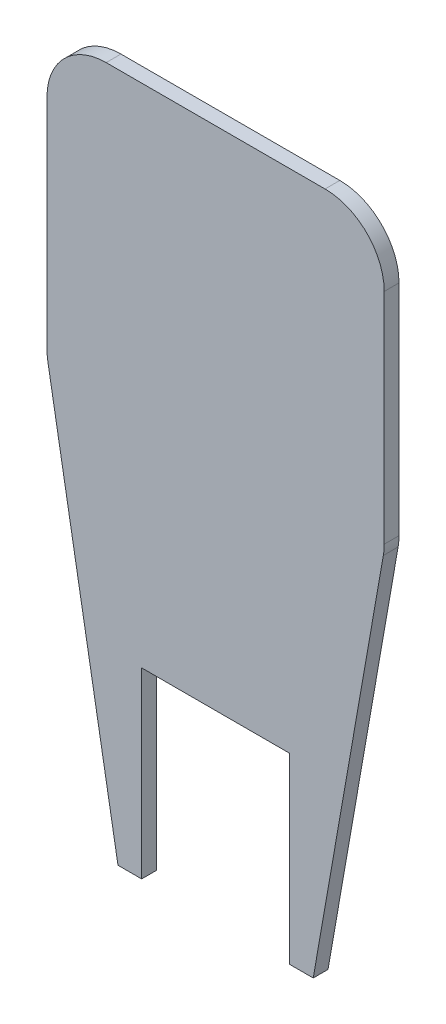
ISO-10303-21;
HEADER;
FILE_DESCRIPTION(('STEP AP214'),'2;1');
FILE_NAME('part.step','',(''),(''),'','','');
FILE_SCHEMA(('AUTOMOTIVE_DESIGN { 1 0 10303 214 1 1 1 1 }'));
ENDSEC;
DATA;
#1=APPLICATION_CONTEXT('core data for automotive mechanical design processes');
#2=APPLICATION_PROTOCOL_DEFINITION('international standard','automotive_design',2000,#1);
#3=PRODUCT_CONTEXT('',#1,'mechanical');
#4=PRODUCT('Part','Part','',(#3));
#5=PRODUCT_RELATED_PRODUCT_CATEGORY('part','',(#4));
#6=PRODUCT_DEFINITION_FORMATION('','',#4);
#7=PRODUCT_DEFINITION_CONTEXT('part definition',#1,'design');
#8=PRODUCT_DEFINITION('design','',#6,#7);
#9=PRODUCT_DEFINITION_SHAPE('','',#8);
#10=(LENGTH_UNIT() NAMED_UNIT(*) SI_UNIT(.MILLI.,.METRE.));
#11=(NAMED_UNIT(*) PLANE_ANGLE_UNIT() SI_UNIT($,.RADIAN.));
#12=(NAMED_UNIT(*) SI_UNIT($,.STERADIAN.) SOLID_ANGLE_UNIT());
#13=UNCERTAINTY_MEASURE_WITH_UNIT(LENGTH_MEASURE(1.E-05),#10,'distance_accuracy_value','');
#14=(GEOMETRIC_REPRESENTATION_CONTEXT(3) GLOBAL_UNCERTAINTY_ASSIGNED_CONTEXT((#13)) GLOBAL_UNIT_ASSIGNED_CONTEXT((#10,
#11,#12)) REPRESENTATION_CONTEXT('',''));
#15=CARTESIAN_POINT('',(0.,0.,0.));
#16=DIRECTION('',(0.,0.,1.));
#17=DIRECTION('',(1.,0.,0.));
#18=AXIS2_PLACEMENT_3D('',#15,#16,#17);
#19=CARTESIAN_POINT('',(18.5,18.5,2.5));
#20=DIRECTION('',(0.,0.,-1.));
#21=DIRECTION('',(-1.,0.,0.));
#22=AXIS2_PLACEMENT_3D('',#19,#20,#21);
#23=CYLINDRICAL_SURFACE('',#22,10.);
#24=CARTESIAN_POINT('',(18.5,18.5,0.));
#25=DIRECTION('',(0.,0.,1.));
#26=DIRECTION('',(-1.,0.,0.));
#27=AXIS2_PLACEMENT_3D('',#24,#25,#26);
#28=CIRCLE('',#27,10.);
#29=CARTESIAN_POINT('',(28.5,18.4999999999999,0.));
#30=VERTEX_POINT('',#29);
#31=CARTESIAN_POINT('',(18.4999999999999,28.5,0.));
#32=VERTEX_POINT('',#31);
#33=EDGE_CURVE('E165',#30,#32,#28,.T.);
#34=ORIENTED_EDGE('',*,*,#33,.T.);
#35=DIRECTION('',(0.,0.,-1.));
#36=VECTOR('',#35,1.);
#37=CARTESIAN_POINT('',(18.4999999999999,28.5,2.5));
#38=LINE('',#37,#36);
#39=CARTESIAN_POINT('',(18.4999999999999,28.5,2.5));
#40=VERTEX_POINT('',#39);
#41=EDGE_CURVE('E11',#40,#32,#38,.T.);
#42=ORIENTED_EDGE('',*,*,#41,.F.);
#43=CARTESIAN_POINT('',(18.5,18.5,2.5));
#44=DIRECTION('',(0.,0.,1.));
#45=DIRECTION('',(-1.,0.,0.));
#46=AXIS2_PLACEMENT_3D('',#43,#44,#45);
#47=CIRCLE('',#46,10.);
#48=CARTESIAN_POINT('',(28.5,18.4999999999999,2.5));
#49=VERTEX_POINT('',#48);
#50=EDGE_CURVE('E191',#49,#40,#47,.T.);
#51=ORIENTED_EDGE('',*,*,#50,.F.);
#52=DIRECTION('',(0.,0.,-1.));
#53=VECTOR('',#52,1.);
#54=CARTESIAN_POINT('',(28.5,18.4999999999999,2.5));
#55=LINE('',#54,#53);
#56=EDGE_CURVE('E161',#49,#30,#55,.T.);
#57=ORIENTED_EDGE('',*,*,#56,.T.);
#58=EDGE_LOOP('',(#34,#42,#51,#57));
#59=FACE_BOUND('',#58,.T.);
#60=ADVANCED_FACE('F33',(#59),#23,.T.);
#61=CARTESIAN_POINT('',(-18.4999999999999,28.5,2.5));
#62=DIRECTION('',(0.,-1.,0.));
#63=DIRECTION('',(0.,0.,-1.));
#64=AXIS2_PLACEMENT_3D('',#61,#62,#63);
#65=PLANE('',#64);
#66=DIRECTION('',(-1.,0.,0.));
#67=VECTOR('',#66,1.);
#68=CARTESIAN_POINT('',(-18.4999999999999,28.5,0.));
#69=LINE('',#68,#67);
#70=CARTESIAN_POINT('',(-18.4999999999999,28.5,0.));
#71=VERTEX_POINT('',#70);
#72=EDGE_CURVE('E168',#32,#71,#69,.T.);
#73=ORIENTED_EDGE('',*,*,#72,.T.);
#74=DIRECTION('',(0.,0.,-1.));
#75=VECTOR('',#74,1.);
#76=CARTESIAN_POINT('',(-18.4999999999999,28.5,2.5));
#77=LINE('',#76,#75);
#78=CARTESIAN_POINT('',(-18.4999999999999,28.5,2.5));
#79=VERTEX_POINT('',#78);
#80=EDGE_CURVE('E41',#79,#71,#77,.T.);
#81=ORIENTED_EDGE('',*,*,#80,.F.);
#82=DIRECTION('',(-1.,0.,0.));
#83=VECTOR('',#82,1.);
#84=CARTESIAN_POINT('',(-18.4999999999999,28.5,2.5));
#85=LINE('',#84,#83);
#86=EDGE_CURVE('E110',#40,#79,#85,.T.);
#87=ORIENTED_EDGE('',*,*,#86,.F.);
#88=ORIENTED_EDGE('',*,*,#41,.T.);
#89=EDGE_LOOP('',(#73,#81,#87,#88));
#90=FACE_BOUND('',#89,.T.);
#91=ADVANCED_FACE('F279',(#90),#65,.F.);
#92=CARTESIAN_POINT('',(-18.5,18.5,2.5));
#93=DIRECTION('',(0.,0.,-1.));
#94=DIRECTION('',(-1.,0.,0.));
#95=AXIS2_PLACEMENT_3D('',#92,#93,#94);
#96=CYLINDRICAL_SURFACE('',#95,10.);
#97=CARTESIAN_POINT('',(-18.5,18.5,0.));
#98=DIRECTION('',(0.,0.,1.));
#99=DIRECTION('',(1.,0.,0.));
#100=AXIS2_PLACEMENT_3D('',#97,#98,#99);
#101=CIRCLE('',#100,10.);
#102=CARTESIAN_POINT('',(-28.5,18.4999999999999,0.));
#103=VERTEX_POINT('',#102);
#104=EDGE_CURVE('E170',#71,#103,#101,.T.);
#105=ORIENTED_EDGE('',*,*,#104,.T.);
#106=DIRECTION('',(0.,0.,-1.));
#107=VECTOR('',#106,1.);
#108=CARTESIAN_POINT('',(-28.5,18.4999999999999,2.5));
#109=LINE('',#108,#107);
#110=CARTESIAN_POINT('',(-28.5,18.4999999999999,2.5));
#111=VERTEX_POINT('',#110);
#112=EDGE_CURVE('E216',#111,#103,#109,.T.);
#113=ORIENTED_EDGE('',*,*,#112,.F.);
#114=CARTESIAN_POINT('',(-18.5,18.5,2.5));
#115=DIRECTION('',(0.,0.,1.));
#116=DIRECTION('',(1.,0.,0.));
#117=AXIS2_PLACEMENT_3D('',#114,#115,#116);
#118=CIRCLE('',#117,10.);
#119=EDGE_CURVE('E224',#79,#111,#118,.T.);
#120=ORIENTED_EDGE('',*,*,#119,.F.);
#121=ORIENTED_EDGE('',*,*,#80,.T.);
#122=EDGE_LOOP('',(#105,#113,#120,#121));
#123=FACE_BOUND('',#122,.T.);
#124=ADVANCED_FACE('F222',(#123),#96,.T.);
#125=CARTESIAN_POINT('',(-28.5,18.4999999999999,2.5));
#126=DIRECTION('',(1.,0.,0.));
#127=DIRECTION('',(0.,1.,0.));
#128=AXIS2_PLACEMENT_3D('',#125,#126,#127);
#129=PLANE('',#128);
#130=DIRECTION('',(0.,-1.,0.));
#131=VECTOR('',#130,1.);
#132=CARTESIAN_POINT('',(-28.5,18.4999999999999,0.));
#133=LINE('',#132,#131);
#134=CARTESIAN_POINT('',(-28.5,-18.4999999999999,0.));
#135=VERTEX_POINT('',#134);
#136=EDGE_CURVE('E172',#103,#135,#133,.T.);
#137=ORIENTED_EDGE('',*,*,#136,.T.);
#138=DIRECTION('',(0.,0.,-1.));
#139=VECTOR('',#138,1.);
#140=CARTESIAN_POINT('',(-28.5,-18.4999999999999,2.5));
#141=LINE('',#140,#139);
#142=CARTESIAN_POINT('',(-28.5,-18.4999999999999,2.5));
#143=VERTEX_POINT('',#142);
#144=EDGE_CURVE('E213',#143,#135,#141,.T.);
#145=ORIENTED_EDGE('',*,*,#144,.F.);
#146=DIRECTION('',(0.,-1.,0.));
#147=VECTOR('',#146,1.);
#148=CARTESIAN_POINT('',(-28.5,18.4999999999999,2.5));
#149=LINE('',#148,#147);
#150=EDGE_CURVE('E242',#111,#143,#149,.T.);
#151=ORIENTED_EDGE('',*,*,#150,.F.);
#152=ORIENTED_EDGE('',*,*,#112,.T.);
#153=EDGE_LOOP('',(#137,#145,#151,#152));
#154=FACE_BOUND('',#153,.T.);
#155=ADVANCED_FACE('F233',(#154),#129,.F.);
#156=CARTESIAN_POINT('',(-18.5,-18.5,2.5));
#157=DIRECTION('',(0.,0.,-1.));
#158=DIRECTION('',(-1.,0.,0.));
#159=AXIS2_PLACEMENT_3D('',#156,#157,#158);
#160=CYLINDRICAL_SURFACE('',#159,10.);
#161=CARTESIAN_POINT('',(-18.5,-18.5,0.));
#162=DIRECTION('',(0.,0.,1.));
#163=DIRECTION('',(1.,0.,0.));
#164=AXIS2_PLACEMENT_3D('',#161,#162,#163);
#165=CIRCLE('',#164,10.);
#166=CARTESIAN_POINT('',(-28.3505644166904,-20.2223184004803,0.));
#167=VERTEX_POINT('',#166);
#168=EDGE_CURVE('E174',#135,#167,#165,.T.);
#169=ORIENTED_EDGE('',*,*,#168,.T.);
#170=DIRECTION('',(0.,0.,-1.));
#171=VECTOR('',#170,1.);
#172=CARTESIAN_POINT('',(-28.3505644166904,-20.2223184004803,2.5));
#173=LINE('',#172,#171);
#174=CARTESIAN_POINT('',(-28.3505644166904,-20.2223184004803,2.5));
#175=VERTEX_POINT('',#174);
#176=EDGE_CURVE('E210',#175,#167,#173,.T.);
#177=ORIENTED_EDGE('',*,*,#176,.F.);
#178=CARTESIAN_POINT('',(-18.5,-18.5,2.5));
#179=DIRECTION('',(0.,0.,1.));
#180=DIRECTION('',(1.,0.,0.));
#181=AXIS2_PLACEMENT_3D('',#178,#179,#180);
#182=CIRCLE('',#181,10.);
#183=EDGE_CURVE('E239',#143,#175,#182,.T.);
#184=ORIENTED_EDGE('',*,*,#183,.F.);
#185=ORIENTED_EDGE('',*,*,#144,.T.);
#186=EDGE_LOOP('',(#169,#177,#184,#185));
#187=FACE_BOUND('',#186,.T.);
#188=ADVANCED_FACE('F237',(#187),#160,.T.);
#189=CARTESIAN_POINT('',(-16.5,-88.,2.5));
#190=DIRECTION('',(0.985056441669039,0.17223184004803,0.));
#191=DIRECTION('',(-0.17223184004803,0.985056441669039,0.));
#192=AXIS2_PLACEMENT_3D('',#189,#190,#191);
#193=PLANE('',#192);
#194=DIRECTION('',(0.17223184004803,-0.98505644166904,0.));
#195=VECTOR('',#194,1.);
#196=CARTESIAN_POINT('',(-16.5,-88.,0.));
#197=LINE('',#196,#195);
#198=CARTESIAN_POINT('',(-16.5,-88.,0.));
#199=VERTEX_POINT('',#198);
#200=EDGE_CURVE('E176',#167,#199,#197,.T.);
#201=ORIENTED_EDGE('',*,*,#200,.T.);
#202=DIRECTION('',(0.,0.,-1.));
#203=VECTOR('',#202,1.);
#204=CARTESIAN_POINT('',(-16.5,-88.,2.5));
#205=LINE('',#204,#203);
#206=CARTESIAN_POINT('',(-16.5,-88.,2.5));
#207=VERTEX_POINT('',#206);
#208=EDGE_CURVE('E207',#207,#199,#205,.T.);
#209=ORIENTED_EDGE('',*,*,#208,.F.);
#210=DIRECTION('',(0.17223184004803,-0.98505644166904,0.));
#211=VECTOR('',#210,1.);
#212=CARTESIAN_POINT('',(-16.5,-88.,2.5));
#213=LINE('',#212,#211);
#214=EDGE_CURVE('E241',#175,#207,#213,.T.);
#215=ORIENTED_EDGE('',*,*,#214,.F.);
#216=ORIENTED_EDGE('',*,*,#176,.T.);
#217=EDGE_LOOP('',(#201,#209,#215,#216));
#218=FACE_BOUND('',#217,.T.);
#219=ADVANCED_FACE('F292',(#218),#193,.F.);
#220=CARTESIAN_POINT('',(-16.5,-88.,2.5));
#221=DIRECTION('',(0.,1.,0.));
#222=DIRECTION('',(0.,0.,1.));
#223=AXIS2_PLACEMENT_3D('',#220,#221,#222);
#224=PLANE('',#223);
#225=DIRECTION('',(1.,0.,0.));
#226=VECTOR('',#225,1.);
#227=CARTESIAN_POINT('',(-16.5,-88.,0.));
#228=LINE('',#227,#226);
#229=CARTESIAN_POINT('',(-12.5,-88.,0.));
#230=VERTEX_POINT('',#229);
#231=EDGE_CURVE('E178',#199,#230,#228,.T.);
#232=ORIENTED_EDGE('',*,*,#231,.T.);
#233=DIRECTION('',(0.,0.,-1.));
#234=VECTOR('',#233,1.);
#235=CARTESIAN_POINT('',(-12.5,-88.,2.5));
#236=LINE('',#235,#234);
#237=CARTESIAN_POINT('',(-12.5,-88.,2.5));
#238=VERTEX_POINT('',#237);
#239=EDGE_CURVE('E204',#238,#230,#236,.T.);
#240=ORIENTED_EDGE('',*,*,#239,.F.);
#241=DIRECTION('',(1.,0.,0.));
#242=VECTOR('',#241,1.);
#243=CARTESIAN_POINT('',(-16.5,-88.,2.5));
#244=LINE('',#243,#242);
#245=EDGE_CURVE('E244',#207,#238,#244,.T.);
#246=ORIENTED_EDGE('',*,*,#245,.F.);
#247=ORIENTED_EDGE('',*,*,#208,.T.);
#248=EDGE_LOOP('',(#232,#240,#246,#247));
#249=FACE_BOUND('',#248,.T.);
#250=ADVANCED_FACE('F295',(#249),#224,.F.);
#251=CARTESIAN_POINT('',(-12.5,-57.1,2.5));
#252=DIRECTION('',(-1.,0.,0.));
#253=DIRECTION('',(0.,0.,1.));
#254=AXIS2_PLACEMENT_3D('',#251,#252,#253);
#255=PLANE('',#254);
#256=DIRECTION('',(0.,1.,0.));
#257=VECTOR('',#256,1.);
#258=CARTESIAN_POINT('',(-12.5,-57.1,0.));
#259=LINE('',#258,#257);
#260=CARTESIAN_POINT('',(-12.5,-57.1,0.));
#261=VERTEX_POINT('',#260);
#262=EDGE_CURVE('E180',#230,#261,#259,.T.);
#263=ORIENTED_EDGE('',*,*,#262,.T.);
#264=DIRECTION('',(0.,0.,-1.));
#265=VECTOR('',#264,1.);
#266=CARTESIAN_POINT('',(-12.5,-57.1,2.5));
#267=LINE('',#266,#265);
#268=CARTESIAN_POINT('',(-12.5,-57.1,2.5));
#269=VERTEX_POINT('',#268);
#270=EDGE_CURVE('E201',#269,#261,#267,.T.);
#271=ORIENTED_EDGE('',*,*,#270,.F.);
#272=DIRECTION('',(0.,1.,0.));
#273=VECTOR('',#272,1.);
#274=CARTESIAN_POINT('',(-12.5,-57.1,2.5));
#275=LINE('',#274,#273);
#276=EDGE_CURVE('E250',#238,#269,#275,.T.);
#277=ORIENTED_EDGE('',*,*,#276,.F.);
#278=ORIENTED_EDGE('',*,*,#239,.T.);
#279=EDGE_LOOP('',(#263,#271,#277,#278));
#280=FACE_BOUND('',#279,.T.);
#281=ADVANCED_FACE('F299',(#280),#255,.F.);
#282=CARTESIAN_POINT('',(-12.5,-57.1,2.5));
#283=DIRECTION('',(0.,1.,0.));
#284=DIRECTION('',(0.,0.,1.));
#285=AXIS2_PLACEMENT_3D('',#282,#283,#284);
#286=PLANE('',#285);
#287=DIRECTION('',(1.,0.,0.));
#288=VECTOR('',#287,1.);
#289=CARTESIAN_POINT('',(-12.5,-57.1,0.));
#290=LINE('',#289,#288);
#291=CARTESIAN_POINT('',(12.5,-57.1,0.));
#292=VERTEX_POINT('',#291);
#293=EDGE_CURVE('E182',#261,#292,#290,.T.);
#294=ORIENTED_EDGE('',*,*,#293,.T.);
#295=DIRECTION('',(0.,0.,-1.));
#296=VECTOR('',#295,1.);
#297=CARTESIAN_POINT('',(12.5,-57.1,2.5));
#298=LINE('',#297,#296);
#299=CARTESIAN_POINT('',(12.5,-57.1,2.5));
#300=VERTEX_POINT('',#299);
#301=EDGE_CURVE('E198',#300,#292,#298,.T.);
#302=ORIENTED_EDGE('',*,*,#301,.F.);
#303=DIRECTION('',(1.,0.,0.));
#304=VECTOR('',#303,1.);
#305=CARTESIAN_POINT('',(-12.5,-57.1,2.5));
#306=LINE('',#305,#304);
#307=EDGE_CURVE('E252',#269,#300,#306,.T.);
#308=ORIENTED_EDGE('',*,*,#307,.F.);
#309=ORIENTED_EDGE('',*,*,#270,.T.);
#310=EDGE_LOOP('',(#294,#302,#308,#309));
#311=FACE_BOUND('',#310,.T.);
#312=ADVANCED_FACE('F303',(#311),#286,.F.);
#313=CARTESIAN_POINT('',(12.5,-57.1,2.5));
#314=DIRECTION('',(1.,0.,0.));
#315=DIRECTION('',(0.,0.,-1.));
#316=AXIS2_PLACEMENT_3D('',#313,#314,#315);
#317=PLANE('',#316);
#318=DIRECTION('',(0.,-1.,0.));
#319=VECTOR('',#318,1.);
#320=CARTESIAN_POINT('',(12.5,-57.1,0.));
#321=LINE('',#320,#319);
#322=CARTESIAN_POINT('',(12.5,-88.,0.));
#323=VERTEX_POINT('',#322);
#324=EDGE_CURVE('E184',#292,#323,#321,.T.);
#325=ORIENTED_EDGE('',*,*,#324,.T.);
#326=DIRECTION('',(0.,0.,-1.));
#327=VECTOR('',#326,1.);
#328=CARTESIAN_POINT('',(12.5,-88.,2.5));
#329=LINE('',#328,#327);
#330=CARTESIAN_POINT('',(12.5,-88.,2.5));
#331=VERTEX_POINT('',#330);
#332=EDGE_CURVE('E195',#331,#323,#329,.T.);
#333=ORIENTED_EDGE('',*,*,#332,.F.);
#334=DIRECTION('',(0.,-1.,0.));
#335=VECTOR('',#334,1.);
#336=CARTESIAN_POINT('',(12.5,-57.1,2.5));
#337=LINE('',#336,#335);
#338=EDGE_CURVE('E254',#300,#331,#337,.T.);
#339=ORIENTED_EDGE('',*,*,#338,.F.);
#340=ORIENTED_EDGE('',*,*,#301,.T.);
#341=EDGE_LOOP('',(#325,#333,#339,#340));
#342=FACE_BOUND('',#341,.T.);
#343=ADVANCED_FACE('F260',(#342),#317,.F.);
#344=CARTESIAN_POINT('',(12.5,-88.,2.5));
#345=DIRECTION('',(0.,1.,0.));
#346=DIRECTION('',(-1.,0.,0.));
#347=AXIS2_PLACEMENT_3D('',#344,#345,#346);
#348=PLANE('',#347);
#349=DIRECTION('',(1.,0.,0.));
#350=VECTOR('',#349,1.);
#351=CARTESIAN_POINT('',(12.5,-88.,0.));
#352=LINE('',#351,#350);
#353=CARTESIAN_POINT('',(16.5,-88.,0.));
#354=VERTEX_POINT('',#353);
#355=EDGE_CURVE('E186',#323,#354,#352,.T.);
#356=ORIENTED_EDGE('',*,*,#355,.T.);
#357=DIRECTION('',(0.,0.,-1.));
#358=VECTOR('',#357,1.);
#359=CARTESIAN_POINT('',(16.5,-88.,2.5));
#360=LINE('',#359,#358);
#361=CARTESIAN_POINT('',(16.5,-88.,2.5));
#362=VERTEX_POINT('',#361);
#363=EDGE_CURVE('E156',#362,#354,#360,.T.);
#364=ORIENTED_EDGE('',*,*,#363,.F.);
#365=DIRECTION('',(1.,0.,0.));
#366=VECTOR('',#365,1.);
#367=CARTESIAN_POINT('',(12.5,-88.,2.5));
#368=LINE('',#367,#366);
#369=EDGE_CURVE('E147',#331,#362,#368,.T.);
#370=ORIENTED_EDGE('',*,*,#369,.F.);
#371=ORIENTED_EDGE('',*,*,#332,.T.);
#372=EDGE_LOOP('',(#356,#364,#370,#371));
#373=FACE_BOUND('',#372,.T.);
#374=ADVANCED_FACE('F264',(#373),#348,.F.);
#375=CARTESIAN_POINT('',(28.3505644166904,-20.2223184004803,2.5));
#376=DIRECTION('',(-0.985056441669039,0.17223184004803,0.));
#377=DIRECTION('',(-0.17223184004803,-0.985056441669039,0.));
#378=AXIS2_PLACEMENT_3D('',#375,#376,#377);
#379=PLANE('',#378);
#380=DIRECTION('',(0.17223184004803,0.98505644166904,0.));
#381=VECTOR('',#380,1.);
#382=CARTESIAN_POINT('',(28.3505644166904,-20.2223184004803,0.));
#383=LINE('',#382,#381);
#384=CARTESIAN_POINT('',(28.3505644166904,-20.2223184004803,0.));
#385=VERTEX_POINT('',#384);
#386=EDGE_CURVE('E155',#354,#385,#383,.T.);
#387=ORIENTED_EDGE('',*,*,#386,.T.);
#388=DIRECTION('',(0.,0.,-1.));
#389=VECTOR('',#388,1.);
#390=CARTESIAN_POINT('',(28.3505644166904,-20.2223184004803,2.5));
#391=LINE('',#390,#389);
#392=CARTESIAN_POINT('',(28.3505644166904,-20.2223184004803,2.5));
#393=VERTEX_POINT('',#392);
#394=EDGE_CURVE('E152',#393,#385,#391,.T.);
#395=ORIENTED_EDGE('',*,*,#394,.F.);
#396=DIRECTION('',(0.17223184004803,0.98505644166904,0.));
#397=VECTOR('',#396,1.);
#398=CARTESIAN_POINT('',(28.3505644166904,-20.2223184004803,2.5));
#399=LINE('',#398,#397);
#400=EDGE_CURVE('E141',#362,#393,#399,.T.);
#401=ORIENTED_EDGE('',*,*,#400,.F.);
#402=ORIENTED_EDGE('',*,*,#363,.T.);
#403=EDGE_LOOP('',(#387,#395,#401,#402));
#404=FACE_BOUND('',#403,.T.);
#405=ADVANCED_FACE('F153',(#404),#379,.F.);
#406=CARTESIAN_POINT('',(18.5,-18.5,2.5));
#407=DIRECTION('',(0.,0.,-1.));
#408=DIRECTION('',(-1.,0.,0.));
#409=AXIS2_PLACEMENT_3D('',#406,#407,#408);
#410=CYLINDRICAL_SURFACE('',#409,10.);
#411=CARTESIAN_POINT('',(18.5,-18.5,0.));
#412=DIRECTION('',(0.,0.,1.));
#413=DIRECTION('',(1.,0.,0.));
#414=AXIS2_PLACEMENT_3D('',#411,#412,#413);
#415=CIRCLE('',#414,10.);
#416=CARTESIAN_POINT('',(28.5,-18.5,0.));
#417=VERTEX_POINT('',#416);
#418=EDGE_CURVE('E96',#385,#417,#415,.T.);
#419=ORIENTED_EDGE('',*,*,#418,.T.);
#420=DIRECTION('',(0.,0.,-1.));
#421=VECTOR('',#420,1.);
#422=CARTESIAN_POINT('',(28.5,-18.5,2.5));
#423=LINE('',#422,#421);
#424=CARTESIAN_POINT('',(28.5,-18.5,2.5));
#425=VERTEX_POINT('',#424);
#426=EDGE_CURVE('E157',#425,#417,#423,.T.);
#427=ORIENTED_EDGE('',*,*,#426,.F.);
#428=CARTESIAN_POINT('',(18.5,-18.5,2.5));
#429=DIRECTION('',(0.,0.,1.));
#430=DIRECTION('',(1.,0.,0.));
#431=AXIS2_PLACEMENT_3D('',#428,#429,#430);
#432=CIRCLE('',#431,10.);
#433=EDGE_CURVE('E145',#393,#425,#432,.T.);
#434=ORIENTED_EDGE('',*,*,#433,.F.);
#435=ORIENTED_EDGE('',*,*,#394,.T.);
#436=EDGE_LOOP('',(#419,#427,#434,#435));
#437=FACE_BOUND('',#436,.T.);
#438=ADVANCED_FACE('F159',(#437),#410,.T.);
#439=CARTESIAN_POINT('',(28.5,18.4999999999999,2.5));
#440=DIRECTION('',(-1.,0.,0.));
#441=DIRECTION('',(0.,-1.,0.));
#442=AXIS2_PLACEMENT_3D('',#439,#440,#441);
#443=PLANE('',#442);
#444=DIRECTION('',(0.,1.,0.));
#445=VECTOR('',#444,1.);
#446=CARTESIAN_POINT('',(28.5,18.4999999999999,0.));
#447=LINE('',#446,#445);
#448=EDGE_CURVE('E102',#417,#30,#447,.T.);
#449=ORIENTED_EDGE('',*,*,#448,.T.);
#450=ORIENTED_EDGE('',*,*,#56,.F.);
#451=DIRECTION('',(0.,1.,0.));
#452=VECTOR('',#451,1.);
#453=CARTESIAN_POINT('',(28.5,18.4999999999999,2.5));
#454=LINE('',#453,#452);
#455=EDGE_CURVE('E49',#425,#49,#454,.T.);
#456=ORIENTED_EDGE('',*,*,#455,.F.);
#457=ORIENTED_EDGE('',*,*,#426,.T.);
#458=EDGE_LOOP('',(#449,#450,#456,#457));
#459=FACE_BOUND('',#458,.T.);
#460=ADVANCED_FACE('F268',(#459),#443,.F.);
#461=CARTESIAN_POINT('',(18.5,18.5,2.5));
#462=DIRECTION('',(0.,0.,-1.));
#463=DIRECTION('',(-1.,0.,0.));
#464=AXIS2_PLACEMENT_3D('',#461,#462,#463);
#465=PLANE('',#464);
#466=ORIENTED_EDGE('',*,*,#50,.T.);
#467=ORIENTED_EDGE('',*,*,#86,.T.);
#468=ORIENTED_EDGE('',*,*,#119,.T.);
#469=ORIENTED_EDGE('',*,*,#150,.T.);
#470=ORIENTED_EDGE('',*,*,#183,.T.);
#471=ORIENTED_EDGE('',*,*,#214,.T.);
#472=ORIENTED_EDGE('',*,*,#245,.T.);
#473=ORIENTED_EDGE('',*,*,#276,.T.);
#474=ORIENTED_EDGE('',*,*,#307,.T.);
#475=ORIENTED_EDGE('',*,*,#338,.T.);
#476=ORIENTED_EDGE('',*,*,#369,.T.);
#477=ORIENTED_EDGE('',*,*,#400,.T.);
#478=ORIENTED_EDGE('',*,*,#433,.T.);
#479=ORIENTED_EDGE('',*,*,#455,.T.);
#480=EDGE_LOOP('',(#466,#467,#468,#469,#470,#471,#472,#473,#474,#475,#476,#477,#478,#479));
#481=FACE_BOUND('',#480,.T.);
#482=ADVANCED_FACE('F143',(#481),#465,.F.);
#483=CARTESIAN_POINT('',(18.5,18.5,0.));
#484=DIRECTION('',(0.,0.,-1.));
#485=DIRECTION('',(-1.,0.,0.));
#486=AXIS2_PLACEMENT_3D('',#483,#484,#485);
#487=PLANE('',#486);
#488=ORIENTED_EDGE('',*,*,#33,.F.);
#489=ORIENTED_EDGE('',*,*,#448,.F.);
#490=ORIENTED_EDGE('',*,*,#418,.F.);
#491=ORIENTED_EDGE('',*,*,#386,.F.);
#492=ORIENTED_EDGE('',*,*,#355,.F.);
#493=ORIENTED_EDGE('',*,*,#324,.F.);
#494=ORIENTED_EDGE('',*,*,#293,.F.);
#495=ORIENTED_EDGE('',*,*,#262,.F.);
#496=ORIENTED_EDGE('',*,*,#231,.F.);
#497=ORIENTED_EDGE('',*,*,#200,.F.);
#498=ORIENTED_EDGE('',*,*,#168,.F.);
#499=ORIENTED_EDGE('',*,*,#136,.F.);
#500=ORIENTED_EDGE('',*,*,#104,.F.);
#501=ORIENTED_EDGE('',*,*,#72,.F.);
#502=EDGE_LOOP('',(#488,#489,#490,#491,#492,#493,#494,#495,#496,#497,#498,#499,#500,#501));
#503=FACE_BOUND('',#502,.T.);
#504=ADVANCED_FACE('F228',(#503),#487,.T.);
#505=CLOSED_SHELL('',(#60,#91,#124,#155,#188,#219,#250,#281,#312,#343,#374,#405,#438,#460,#482,#504));
#506=MANIFOLD_SOLID_BREP('B2',#505);
#507=ADVANCED_BREP_SHAPE_REPRESENTATION('',(#18,#506),#14);
#508=SHAPE_DEFINITION_REPRESENTATION(#9,#507);
ENDSEC;
END-ISO-10303-21;
